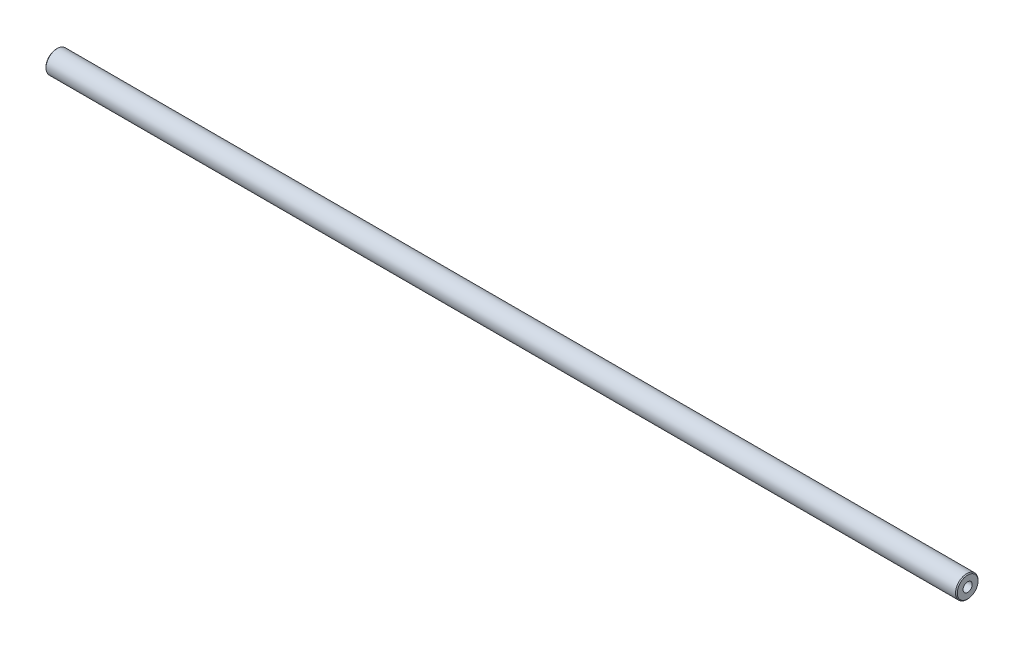
ISO-10303-21;
HEADER;
FILE_DESCRIPTION(('STEP AP214'),'2;1');
FILE_NAME('part.step','',(''),(''),'','','');
FILE_SCHEMA(('AUTOMOTIVE_DESIGN { 1 0 10303 214 1 1 1 1 }'));
ENDSEC;
DATA;
#1=APPLICATION_CONTEXT('core data for automotive mechanical design processes');
#2=APPLICATION_PROTOCOL_DEFINITION('international standard','automotive_design',2000,#1);
#3=PRODUCT_CONTEXT('',#1,'mechanical');
#4=PRODUCT('Part','Part','',(#3));
#5=PRODUCT_RELATED_PRODUCT_CATEGORY('part','',(#4));
#6=PRODUCT_DEFINITION_FORMATION('','',#4);
#7=PRODUCT_DEFINITION_CONTEXT('part definition',#1,'design');
#8=PRODUCT_DEFINITION('design','',#6,#7);
#9=PRODUCT_DEFINITION_SHAPE('','',#8);
#10=(LENGTH_UNIT() NAMED_UNIT(*) SI_UNIT(.MILLI.,.METRE.));
#11=(NAMED_UNIT(*) PLANE_ANGLE_UNIT() SI_UNIT($,.RADIAN.));
#12=(NAMED_UNIT(*) SI_UNIT($,.STERADIAN.) SOLID_ANGLE_UNIT());
#13=UNCERTAINTY_MEASURE_WITH_UNIT(LENGTH_MEASURE(1.E-05),#10,'distance_accuracy_value','');
#14=(GEOMETRIC_REPRESENTATION_CONTEXT(3) GLOBAL_UNCERTAINTY_ASSIGNED_CONTEXT((#13)) GLOBAL_UNIT_ASSIGNED_CONTEXT((#10,
#11,#12)) REPRESENTATION_CONTEXT('',''));
#15=CARTESIAN_POINT('',(0.,0.,0.));
#16=DIRECTION('',(0.,0.,1.));
#17=DIRECTION('',(1.,0.,0.));
#18=AXIS2_PLACEMENT_3D('',#15,#16,#17);
#19=CARTESIAN_POINT('',(-257.,0.,-2.59999999999994));
#20=DIRECTION('',(1.,0.,0.));
#21=DIRECTION('',(0.,0.,-1.));
#22=AXIS2_PLACEMENT_3D('',#19,#20,#21);
#23=PLANE('',#22);
#24=CARTESIAN_POINT('',(-257.,0.,0.));
#25=DIRECTION('',(1.,0.,0.));
#26=DIRECTION('',(0.,0.,-1.));
#27=AXIS2_PLACEMENT_3D('',#24,#25,#26);
#28=CIRCLE('',#27,5.85000000000002);
#29=CARTESIAN_POINT('',(-257.,0.,-5.85000000000002));
#30=VERTEX_POINT('',#29);
#31=EDGE_CURVE('E11',#30,#30,#28,.F.);
#32=ORIENTED_EDGE('',*,*,#31,.T.);
#33=EDGE_LOOP('',(#32));
#34=FACE_BOUND('',#33,.T.);
#35=CARTESIAN_POINT('',(-257.,0.,0.));
#36=DIRECTION('',(-1.,0.,0.));
#37=DIRECTION('',(0.,0.,1.));
#38=AXIS2_PLACEMENT_3D('',#35,#36,#37);
#39=CIRCLE('',#38,2.59999999999994);
#40=CARTESIAN_POINT('',(-257.,0.,2.59999999999994));
#41=VERTEX_POINT('',#40);
#42=EDGE_CURVE('E56',#41,#41,#39,.T.);
#43=ORIENTED_EDGE('',*,*,#42,.F.);
#44=EDGE_LOOP('',(#43));
#45=FACE_BOUND('',#44,.T.);
#46=ADVANCED_FACE('F31',(#34,#45),#23,.F.);
#47=CARTESIAN_POINT('',(-267.30582997196,0.,0.));
#48=DIRECTION('',(-1.,0.,0.));
#49=DIRECTION('',(0.,0.,1.));
#50=AXIS2_PLACEMENT_3D('',#47,#48,#49);
#51=CYLINDRICAL_SURFACE('',#50,6.35);
#52=CARTESIAN_POINT('',(256.5,0.,0.));
#53=DIRECTION('',(-1.,0.,0.));
#54=DIRECTION('',(0.,0.,1.));
#55=AXIS2_PLACEMENT_3D('',#52,#53,#54);
#56=CIRCLE('',#55,6.35);
#57=CARTESIAN_POINT('',(256.5,0.,6.35));
#58=VERTEX_POINT('',#57);
#59=EDGE_CURVE('E69',#58,#58,#56,.T.);
#60=ORIENTED_EDGE('',*,*,#59,.T.);
#61=EDGE_LOOP('',(#60));
#62=FACE_BOUND('',#61,.T.);
#63=CARTESIAN_POINT('',(-256.5,0.,0.));
#64=DIRECTION('',(1.,0.,0.));
#65=DIRECTION('',(0.,0.,-1.));
#66=AXIS2_PLACEMENT_3D('',#63,#64,#65);
#67=CIRCLE('',#66,6.35);
#68=CARTESIAN_POINT('',(-256.5,0.,-6.35));
#69=VERTEX_POINT('',#68);
#70=EDGE_CURVE('E66',#69,#69,#67,.T.);
#71=ORIENTED_EDGE('',*,*,#70,.T.);
#72=EDGE_LOOP('',(#71));
#73=FACE_BOUND('',#72,.T.);
#74=ADVANCED_FACE('F82',(#62,#73),#51,.T.);
#75=CARTESIAN_POINT('',(257.,0.,-6.35));
#76=DIRECTION('',(-1.,0.,0.));
#77=DIRECTION('',(0.,0.,1.));
#78=AXIS2_PLACEMENT_3D('',#75,#76,#77);
#79=PLANE('',#78);
#80=CARTESIAN_POINT('',(257.,0.,0.));
#81=DIRECTION('',(-1.,0.,0.));
#82=DIRECTION('',(0.,0.,1.));
#83=AXIS2_PLACEMENT_3D('',#80,#81,#82);
#84=CIRCLE('',#83,5.84999999999986);
#85=CARTESIAN_POINT('',(257.,0.,5.84999999999986));
#86=VERTEX_POINT('',#85);
#87=EDGE_CURVE('E39',#86,#86,#84,.F.);
#88=ORIENTED_EDGE('',*,*,#87,.T.);
#89=EDGE_LOOP('',(#88));
#90=FACE_BOUND('',#89,.T.);
#91=CARTESIAN_POINT('',(257.,0.,0.));
#92=DIRECTION('',(-1.,0.,0.));
#93=DIRECTION('',(0.,0.,1.));
#94=AXIS2_PLACEMENT_3D('',#91,#92,#93);
#95=CIRCLE('',#94,2.59999999999994);
#96=CARTESIAN_POINT('',(257.,0.,2.59999999999994));
#97=VERTEX_POINT('',#96);
#98=EDGE_CURVE('E59',#97,#97,#95,.T.);
#99=ORIENTED_EDGE('',*,*,#98,.T.);
#100=EDGE_LOOP('',(#99));
#101=FACE_BOUND('',#100,.T.);
#102=ADVANCED_FACE('F74',(#90,#101),#79,.F.);
#103=CARTESIAN_POINT('',(-267.30582997196,0.,0.));
#104=DIRECTION('',(-1.,0.,0.));
#105=DIRECTION('',(0.,0.,1.));
#106=AXIS2_PLACEMENT_3D('',#103,#104,#105);
#107=CYLINDRICAL_SURFACE('',#106,2.59999999999994);
#108=ORIENTED_EDGE('',*,*,#98,.F.);
#109=EDGE_LOOP('',(#108));
#110=FACE_BOUND('',#109,.T.);
#111=CARTESIAN_POINT('',(235.201110699893,0.,0.));
#112=DIRECTION('',(-1.,0.,0.));
#113=DIRECTION('',(0.,0.,1.));
#114=AXIS2_PLACEMENT_3D('',#111,#112,#113);
#115=CIRCLE('',#114,2.59999999999994);
#116=CARTESIAN_POINT('',(235.201110699893,0.,2.59999999999994));
#117=VERTEX_POINT('',#116);
#118=EDGE_CURVE('E55',#117,#117,#115,.T.);
#119=ORIENTED_EDGE('',*,*,#118,.T.);
#120=EDGE_LOOP('',(#119));
#121=FACE_BOUND('',#120,.T.);
#122=ADVANCED_FACE('F104',(#110,#121),#107,.F.);
#123=CARTESIAN_POINT('',(233.7,0.,0.));
#124=DIRECTION('',(1.,0.,0.));
#125=DIRECTION('',(0.,0.,-1.));
#126=AXIS2_PLACEMENT_3D('',#123,#124,#125);
#127=CONICAL_SURFACE('',#126,0.,1.04719755119659);
#128=ORIENTED_EDGE('',*,*,#118,.F.);
#129=EDGE_LOOP('',(#128));
#130=FACE_BOUND('',#129,.T.);
#131=CARTESIAN_POINT('',(233.7,0.,0.));
#132=VERTEX_POINT('',#131);
#133=VERTEX_LOOP('',#132);
#134=FACE_BOUND('',#133,.T.);
#135=ADVANCED_FACE('F49',(#130,#134),#127,.F.);
#136=CARTESIAN_POINT('',(-235.201110699893,0.,0.));
#137=DIRECTION('',(-1.,0.,0.));
#138=DIRECTION('',(0.,0.,1.));
#139=AXIS2_PLACEMENT_3D('',#136,#137,#138);
#140=CONICAL_SURFACE('',#139,2.59999999999994,1.04719755119657);
#141=CARTESIAN_POINT('',(-233.7,0.,0.));
#142=VERTEX_POINT('',#141);
#143=VERTEX_LOOP('',#142);
#144=FACE_BOUND('',#143,.T.);
#145=CARTESIAN_POINT('',(-235.201110699893,0.,0.));
#146=DIRECTION('',(-1.,0.,0.));
#147=DIRECTION('',(0.,0.,1.));
#148=AXIS2_PLACEMENT_3D('',#145,#146,#147);
#149=CIRCLE('',#148,2.59999999999994);
#150=CARTESIAN_POINT('',(-235.201110699893,0.,2.59999999999994));
#151=VERTEX_POINT('',#150);
#152=EDGE_CURVE('E53',#151,#151,#149,.T.);
#153=ORIENTED_EDGE('',*,*,#152,.T.);
#154=EDGE_LOOP('',(#153));
#155=FACE_BOUND('',#154,.T.);
#156=ADVANCED_FACE('F45',(#144,#155),#140,.F.);
#157=CARTESIAN_POINT('',(-267.30582997196,0.,0.));
#158=DIRECTION('',(-1.,0.,0.));
#159=DIRECTION('',(0.,0.,1.));
#160=AXIS2_PLACEMENT_3D('',#157,#158,#159);
#161=CYLINDRICAL_SURFACE('',#160,2.59999999999994);
#162=ORIENTED_EDGE('',*,*,#152,.F.);
#163=EDGE_LOOP('',(#162));
#164=FACE_BOUND('',#163,.T.);
#165=ORIENTED_EDGE('',*,*,#42,.T.);
#166=EDGE_LOOP('',(#165));
#167=FACE_BOUND('',#166,.T.);
#168=ADVANCED_FACE('F48',(#164,#167),#161,.F.);
#169=CARTESIAN_POINT('',(256.5,0.,0.));
#170=DIRECTION('',(-1.,0.,0.));
#171=DIRECTION('',(0.,0.,1.));
#172=AXIS2_PLACEMENT_3D('',#169,#170,#171);
#173=CONICAL_SURFACE('',#172,6.35,0.785398163397537);
#174=ORIENTED_EDGE('',*,*,#87,.F.);
#175=EDGE_LOOP('',(#174));
#176=FACE_BOUND('',#175,.T.);
#177=ORIENTED_EDGE('',*,*,#59,.F.);
#178=EDGE_LOOP('',(#177));
#179=FACE_BOUND('',#178,.T.);
#180=ADVANCED_FACE('F77',(#176,#179),#173,.T.);
#181=CARTESIAN_POINT('',(-257.,0.,0.));
#182=DIRECTION('',(1.,0.,0.));
#183=DIRECTION('',(0.,0.,-1.));
#184=AXIS2_PLACEMENT_3D('',#181,#182,#183);
#185=CONICAL_SURFACE('',#184,5.85000000000002,0.785398163397481);
#186=ORIENTED_EDGE('',*,*,#70,.F.);
#187=EDGE_LOOP('',(#186));
#188=FACE_BOUND('',#187,.T.);
#189=ORIENTED_EDGE('',*,*,#31,.F.);
#190=EDGE_LOOP('',(#189));
#191=FACE_BOUND('',#190,.T.);
#192=ADVANCED_FACE('F33',(#188,#191),#185,.T.);
#193=CLOSED_SHELL('',(#46,#74,#102,#122,#135,#156,#168,#180,#192));
#194=MANIFOLD_SOLID_BREP('B2',#193);
#195=ADVANCED_BREP_SHAPE_REPRESENTATION('',(#18,#194),#14);
#196=SHAPE_DEFINITION_REPRESENTATION(#9,#195);
ENDSEC;
END-ISO-10303-21;
